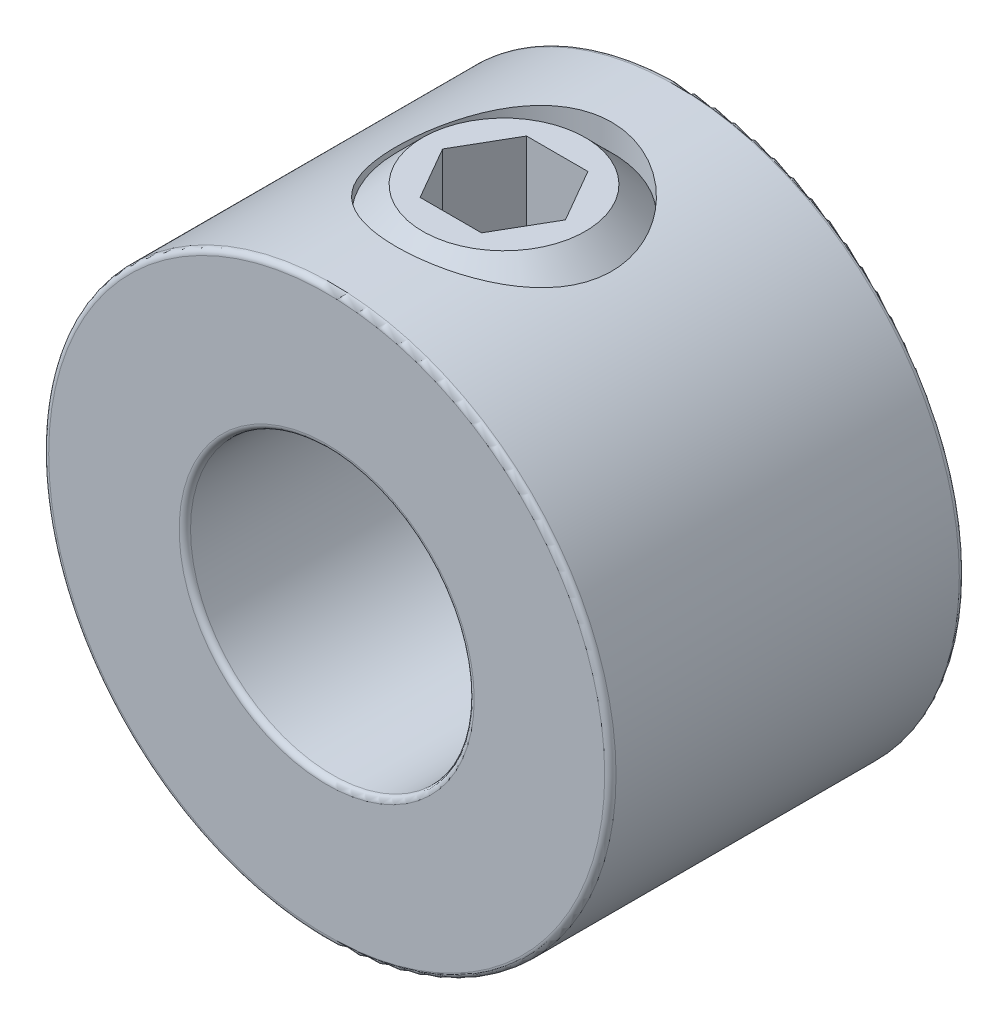
ISO-10303-21;
HEADER;
FILE_DESCRIPTION(('STEP AP214'),'2;1');
FILE_NAME('part.step','',(''),(''),'','','');
FILE_SCHEMA(('AUTOMOTIVE_DESIGN { 1 0 10303 214 1 1 1 1 }'));
ENDSEC;
DATA;
#1=APPLICATION_CONTEXT('core data for automotive mechanical design processes');
#2=APPLICATION_PROTOCOL_DEFINITION('international standard','automotive_design',2000,#1);
#3=PRODUCT_CONTEXT('',#1,'mechanical');
#4=PRODUCT('Part','Part','',(#3));
#5=PRODUCT_RELATED_PRODUCT_CATEGORY('part','',(#4));
#6=PRODUCT_DEFINITION_FORMATION('','',#4);
#7=PRODUCT_DEFINITION_CONTEXT('part definition',#1,'design');
#8=PRODUCT_DEFINITION('design','',#6,#7);
#9=PRODUCT_DEFINITION_SHAPE('','',#8);
#10=(LENGTH_UNIT() NAMED_UNIT(*) SI_UNIT(.MILLI.,.METRE.));
#11=(NAMED_UNIT(*) PLANE_ANGLE_UNIT() SI_UNIT($,.RADIAN.));
#12=(NAMED_UNIT(*) SI_UNIT($,.STERADIAN.) SOLID_ANGLE_UNIT());
#13=UNCERTAINTY_MEASURE_WITH_UNIT(LENGTH_MEASURE(1.E-05),#10,'distance_accuracy_value','');
#14=(GEOMETRIC_REPRESENTATION_CONTEXT(3) GLOBAL_UNCERTAINTY_ASSIGNED_CONTEXT((#13)) GLOBAL_UNIT_ASSIGNED_CONTEXT((#10,
#11,#12)) REPRESENTATION_CONTEXT('',''));
#15=CARTESIAN_POINT('',(0.,0.,0.));
#16=DIRECTION('',(0.,0.,1.));
#17=DIRECTION('',(1.,0.,0.));
#18=AXIS2_PLACEMENT_3D('',#15,#16,#17);
#19=CARTESIAN_POINT('',(0.,6.35,0.));
#20=DIRECTION('',(0.,1.,0.));
#21=DIRECTION('',(-1.,0.,0.));
#22=AXIS2_PLACEMENT_3D('',#19,#20,#21);
#23=PLANE('',#22);
#24=CARTESIAN_POINT('',(0.,6.35,0.));
#25=DIRECTION('',(0.,1.,0.));
#26=DIRECTION('',(-1.,0.,0.));
#27=AXIS2_PLACEMENT_3D('',#24,#25,#26);
#28=CIRCLE('',#27,1.81975161629017);
#29=CARTESIAN_POINT('',(-1.81975161629017,6.35,0.));
#30=VERTEX_POINT('',#29);
#31=EDGE_CURVE('E12',#30,#30,#28,.T.);
#32=ORIENTED_EDGE('',*,*,#31,.T.);
#33=EDGE_LOOP('',(#32));
#34=FACE_BOUND('',#33,.T.);
#35=DIRECTION('',(1.,0.,0.));
#36=VECTOR('',#35,1.);
#37=CARTESIAN_POINT('',(-0.687407664253898,6.34999999999999,-1.190625));
#38=LINE('',#37,#36);
#39=CARTESIAN_POINT('',(-0.687407664253898,6.34999999999999,-1.190625));
#40=VERTEX_POINT('',#39);
#41=CARTESIAN_POINT('',(0.687407664253898,6.35,-1.190625));
#42=VERTEX_POINT('',#41);
#43=EDGE_CURVE('E114',#40,#42,#38,.T.);
#44=ORIENTED_EDGE('',*,*,#43,.T.);
#45=DIRECTION('',(0.5,0.,0.866025403784439));
#46=VECTOR('',#45,1.);
#47=CARTESIAN_POINT('',(0.687407664253898,6.34999999999999,-1.190625));
#48=LINE('',#47,#46);
#49=CARTESIAN_POINT('',(1.3748153285078,6.34999999999999,0.));
#50=VERTEX_POINT('',#49);
#51=EDGE_CURVE('E60',#42,#50,#48,.T.);
#52=ORIENTED_EDGE('',*,*,#51,.T.);
#53=DIRECTION('',(-0.5,0.,0.866025403784439));
#54=VECTOR('',#53,1.);
#55=CARTESIAN_POINT('',(1.3748153285078,6.34999999999999,0.));
#56=LINE('',#55,#54);
#57=CARTESIAN_POINT('',(0.687407664253899,6.34999999999999,1.190625));
#58=VERTEX_POINT('',#57);
#59=EDGE_CURVE('E118',#50,#58,#56,.T.);
#60=ORIENTED_EDGE('',*,*,#59,.T.);
#61=DIRECTION('',(-1.,0.,0.));
#62=VECTOR('',#61,1.);
#63=CARTESIAN_POINT('',(0.687407664253899,6.34999999999999,1.190625));
#64=LINE('',#63,#62);
#65=CARTESIAN_POINT('',(-0.687407664253899,6.34999999999999,1.190625));
#66=VERTEX_POINT('',#65);
#67=EDGE_CURVE('E181',#58,#66,#64,.T.);
#68=ORIENTED_EDGE('',*,*,#67,.T.);
#69=DIRECTION('',(-0.5,0.,-0.866025403784439));
#70=VECTOR('',#69,1.);
#71=CARTESIAN_POINT('',(-0.687407664253899,6.34999999999999,1.190625));
#72=LINE('',#71,#70);
#73=CARTESIAN_POINT('',(-1.3748153285078,6.34999999999999,0.));
#74=VERTEX_POINT('',#73);
#75=EDGE_CURVE('E166',#66,#74,#72,.T.);
#76=ORIENTED_EDGE('',*,*,#75,.T.);
#77=DIRECTION('',(0.5,0.,-0.866025403784439));
#78=VECTOR('',#77,1.);
#79=CARTESIAN_POINT('',(-1.3748153285078,6.34999999999999,0.));
#80=LINE('',#79,#78);
#81=EDGE_CURVE('E162',#74,#40,#80,.T.);
#82=ORIENTED_EDGE('',*,*,#81,.T.);
#83=EDGE_LOOP('',(#44,#52,#60,#68,#76,#82));
#84=FACE_BOUND('',#83,.T.);
#85=ADVANCED_FACE('F46',(#34,#84),#23,.T.);
#86=CARTESIAN_POINT('',(0.,6.35,0.));
#87=DIRECTION('',(0.,-1.,0.));
#88=DIRECTION('',(1.,0.,0.));
#89=AXIS2_PLACEMENT_3D('',#86,#87,#88);
#90=CONICAL_SURFACE('',#89,1.81975161629017,0.785398163397448);
#91=CARTESIAN_POINT('',(0.,5.75675161629017,0.));
#92=DIRECTION('',(0.,1.,0.));
#93=DIRECTION('',(-1.,0.,0.));
#94=AXIS2_PLACEMENT_3D('',#91,#92,#93);
#95=CIRCLE('',#94,2.413);
#96=CARTESIAN_POINT('',(-2.413,5.75675161629017,0.));
#97=VERTEX_POINT('',#96);
#98=EDGE_CURVE('E53',#97,#97,#95,.T.);
#99=ORIENTED_EDGE('',*,*,#98,.T.);
#100=EDGE_LOOP('',(#99));
#101=FACE_BOUND('',#100,.T.);
#102=ORIENTED_EDGE('',*,*,#31,.F.);
#103=EDGE_LOOP('',(#102));
#104=FACE_BOUND('',#103,.T.);
#105=ADVANCED_FACE('F136',(#101,#104),#90,.T.);
#106=CARTESIAN_POINT('',(0.,3.175,0.));
#107=DIRECTION('',(0.,1.,0.));
#108=DIRECTION('',(-1.,0.,0.));
#109=AXIS2_PLACEMENT_3D('',#106,#107,#108);
#110=CYLINDRICAL_SURFACE('',#109,2.413);
#111=CARTESIAN_POINT('',(0.,3.76824838370983,0.));
#112=DIRECTION('',(0.,1.,0.));
#113=DIRECTION('',(-1.,0.,0.));
#114=AXIS2_PLACEMENT_3D('',#111,#112,#113);
#115=CIRCLE('',#114,2.413);
#116=CARTESIAN_POINT('',(-2.413,3.76824838370983,0.));
#117=VERTEX_POINT('',#116);
#118=EDGE_CURVE('E131',#117,#117,#115,.T.);
#119=ORIENTED_EDGE('',*,*,#118,.T.);
#120=EDGE_LOOP('',(#119));
#121=FACE_BOUND('',#120,.T.);
#122=ORIENTED_EDGE('',*,*,#98,.F.);
#123=EDGE_LOOP('',(#122));
#124=FACE_BOUND('',#123,.T.);
#125=ADVANCED_FACE('F139',(#121,#124),#110,.T.);
#126=CARTESIAN_POINT('',(0.,3.76824838370983,0.));
#127=DIRECTION('',(0.,1.,0.));
#128=DIRECTION('',(-1.,0.,0.));
#129=AXIS2_PLACEMENT_3D('',#126,#127,#128);
#130=CONICAL_SURFACE('',#129,2.413,0.785398163397449);
#131=CARTESIAN_POINT('',(0.,3.175,0.));
#132=DIRECTION('',(0.,1.,0.));
#133=DIRECTION('',(-1.,0.,0.));
#134=AXIS2_PLACEMENT_3D('',#131,#132,#133);
#135=CIRCLE('',#134,1.81975161629017);
#136=CARTESIAN_POINT('',(-1.81975161629017,3.175,0.));
#137=VERTEX_POINT('',#136);
#138=EDGE_CURVE('E123',#137,#137,#135,.T.);
#139=ORIENTED_EDGE('',*,*,#138,.T.);
#140=EDGE_LOOP('',(#139));
#141=FACE_BOUND('',#140,.T.);
#142=ORIENTED_EDGE('',*,*,#118,.F.);
#143=EDGE_LOOP('',(#142));
#144=FACE_BOUND('',#143,.T.);
#145=ADVANCED_FACE('F141',(#141,#144),#130,.T.);
#146=CARTESIAN_POINT('',(-1.81975161629017,3.175,0.));
#147=DIRECTION('',(0.,-1.,0.));
#148=DIRECTION('',(1.,0.,0.));
#149=AXIS2_PLACEMENT_3D('',#146,#147,#148);
#150=PLANE('',#149);
#151=CARTESIAN_POINT('',(0.,3.175,0.));
#152=DIRECTION('',(0.,1.,0.));
#153=DIRECTION('',(-1.,0.,0.));
#154=AXIS2_PLACEMENT_3D('',#151,#152,#153);
#155=CIRCLE('',#154,0.711898060451797);
#156=CARTESIAN_POINT('',(-0.711898060451796,3.175,0.));
#157=VERTEX_POINT('',#156);
#158=EDGE_CURVE('E119',#157,#157,#155,.T.);
#159=ORIENTED_EDGE('',*,*,#158,.T.);
#160=EDGE_LOOP('',(#159));
#161=FACE_BOUND('',#160,.T.);
#162=ORIENTED_EDGE('',*,*,#138,.F.);
#163=EDGE_LOOP('',(#162));
#164=FACE_BOUND('',#163,.T.);
#165=ADVANCED_FACE('F148',(#161,#164),#150,.T.);
#166=CARTESIAN_POINT('',(0.,3.175,0.));
#167=DIRECTION('',(0.,-1.,0.));
#168=DIRECTION('',(1.,0.,0.));
#169=AXIS2_PLACEMENT_3D('',#166,#167,#168);
#170=CONICAL_SURFACE('',#169,0.711898060451797,0.785398163397448);
#171=CARTESIAN_POINT('',(0.,3.8868980604518,0.));
#172=VERTEX_POINT('',#171);
#173=VERTEX_LOOP('',#172);
#174=FACE_BOUND('',#173,.T.);
#175=ORIENTED_EDGE('',*,*,#158,.F.);
#176=EDGE_LOOP('',(#175));
#177=FACE_BOUND('',#176,.T.);
#178=ADVANCED_FACE('F215',(#174,#177),#170,.F.);
#179=CARTESIAN_POINT('',(0.687407664253898,3.96874999999999,-1.190625));
#180=DIRECTION('',(-0.866025403784439,0.,0.5));
#181=DIRECTION('',(0.5,0.,0.866025403784438));
#182=AXIS2_PLACEMENT_3D('',#179,#180,#181);
#183=PLANE('',#182);
#184=ORIENTED_EDGE('',*,*,#51,.F.);
#185=DIRECTION('',(0.,1.,0.));
#186=VECTOR('',#185,1.);
#187=CARTESIAN_POINT('',(0.687407664253898,3.96874999999999,-1.190625));
#188=LINE('',#187,#186);
#189=CARTESIAN_POINT('',(0.687407664253898,3.96874999999999,-1.190625));
#190=VERTEX_POINT('',#189);
#191=EDGE_CURVE('E113',#190,#42,#188,.T.);
#192=ORIENTED_EDGE('',*,*,#191,.F.);
#193=DIRECTION('',(0.5,0.,0.866025403784439));
#194=VECTOR('',#193,1.);
#195=CARTESIAN_POINT('',(0.687407664253898,3.96874999999999,-1.190625));
#196=LINE('',#195,#194);
#197=CARTESIAN_POINT('',(1.3748153285078,3.96874999999999,0.));
#198=VERTEX_POINT('',#197);
#199=EDGE_CURVE('E104',#190,#198,#196,.T.);
#200=ORIENTED_EDGE('',*,*,#199,.T.);
#201=DIRECTION('',(0.,1.,0.));
#202=VECTOR('',#201,1.);
#203=CARTESIAN_POINT('',(1.3748153285078,3.96874999999999,0.));
#204=LINE('',#203,#202);
#205=EDGE_CURVE('E112',#198,#50,#204,.T.);
#206=ORIENTED_EDGE('',*,*,#205,.T.);
#207=EDGE_LOOP('',(#184,#192,#200,#206));
#208=FACE_BOUND('',#207,.T.);
#209=ADVANCED_FACE('F111',(#208),#183,.T.);
#210=CARTESIAN_POINT('',(1.3748153285078,3.96874999999999,0.));
#211=DIRECTION('',(-0.866025403784439,0.,-0.5));
#212=DIRECTION('',(-0.5,0.,0.866025403784439));
#213=AXIS2_PLACEMENT_3D('',#210,#211,#212);
#214=PLANE('',#213);
#215=ORIENTED_EDGE('',*,*,#59,.F.);
#216=ORIENTED_EDGE('',*,*,#205,.F.);
#217=DIRECTION('',(-0.5,0.,0.866025403784439));
#218=VECTOR('',#217,1.);
#219=CARTESIAN_POINT('',(1.3748153285078,3.96874999999999,0.));
#220=LINE('',#219,#218);
#221=CARTESIAN_POINT('',(0.687407664253899,3.96874999999999,1.190625));
#222=VERTEX_POINT('',#221);
#223=EDGE_CURVE('E100',#198,#222,#220,.T.);
#224=ORIENTED_EDGE('',*,*,#223,.T.);
#225=DIRECTION('',(0.,1.,0.));
#226=VECTOR('',#225,1.);
#227=CARTESIAN_POINT('',(0.687407664253899,3.96874999999999,1.190625));
#228=LINE('',#227,#226);
#229=EDGE_CURVE('E120',#222,#58,#228,.T.);
#230=ORIENTED_EDGE('',*,*,#229,.T.);
#231=EDGE_LOOP('',(#215,#216,#224,#230));
#232=FACE_BOUND('',#231,.T.);
#233=ADVANCED_FACE('F116',(#232),#214,.T.);
#234=CARTESIAN_POINT('',(0.687407664253899,3.96874999999999,1.190625));
#235=DIRECTION('',(0.,0.,-1.));
#236=DIRECTION('',(-1.,0.,0.));
#237=AXIS2_PLACEMENT_3D('',#234,#235,#236);
#238=PLANE('',#237);
#239=ORIENTED_EDGE('',*,*,#67,.F.);
#240=ORIENTED_EDGE('',*,*,#229,.F.);
#241=DIRECTION('',(-1.,0.,0.));
#242=VECTOR('',#241,1.);
#243=CARTESIAN_POINT('',(0.687407664253899,3.96874999999999,1.190625));
#244=LINE('',#243,#242);
#245=CARTESIAN_POINT('',(-0.687407664253899,3.96874999999999,1.190625));
#246=VERTEX_POINT('',#245);
#247=EDGE_CURVE('E106',#222,#246,#244,.T.);
#248=ORIENTED_EDGE('',*,*,#247,.T.);
#249=DIRECTION('',(0.,1.,0.));
#250=VECTOR('',#249,1.);
#251=CARTESIAN_POINT('',(-0.687407664253899,3.96874999999999,1.190625));
#252=LINE('',#251,#250);
#253=EDGE_CURVE('E125',#246,#66,#252,.T.);
#254=ORIENTED_EDGE('',*,*,#253,.T.);
#255=EDGE_LOOP('',(#239,#240,#248,#254));
#256=FACE_BOUND('',#255,.T.);
#257=ADVANCED_FACE('F179',(#256),#238,.T.);
#258=CARTESIAN_POINT('',(-0.687407664253899,3.96874999999999,1.190625));
#259=DIRECTION('',(0.866025403784439,0.,-0.5));
#260=DIRECTION('',(-0.5,0.,-0.866025403784439));
#261=AXIS2_PLACEMENT_3D('',#258,#259,#260);
#262=PLANE('',#261);
#263=ORIENTED_EDGE('',*,*,#75,.F.);
#264=ORIENTED_EDGE('',*,*,#253,.F.);
#265=DIRECTION('',(-0.5,0.,-0.866025403784439));
#266=VECTOR('',#265,1.);
#267=CARTESIAN_POINT('',(-0.687407664253899,3.96874999999999,1.190625));
#268=LINE('',#267,#266);
#269=CARTESIAN_POINT('',(-1.3748153285078,3.96874999999999,0.));
#270=VERTEX_POINT('',#269);
#271=EDGE_CURVE('E192',#246,#270,#268,.T.);
#272=ORIENTED_EDGE('',*,*,#271,.T.);
#273=DIRECTION('',(0.,1.,0.));
#274=VECTOR('',#273,1.);
#275=CARTESIAN_POINT('',(-1.3748153285078,3.96874999999999,0.));
#276=LINE('',#275,#274);
#277=EDGE_CURVE('E174',#270,#74,#276,.T.);
#278=ORIENTED_EDGE('',*,*,#277,.T.);
#279=EDGE_LOOP('',(#263,#264,#272,#278));
#280=FACE_BOUND('',#279,.T.);
#281=ADVANCED_FACE('F183',(#280),#262,.T.);
#282=CARTESIAN_POINT('',(-1.3748153285078,3.96874999999999,0.));
#283=DIRECTION('',(0.866025403784439,0.,0.5));
#284=DIRECTION('',(0.5,0.,-0.866025403784439));
#285=AXIS2_PLACEMENT_3D('',#282,#283,#284);
#286=PLANE('',#285);
#287=ORIENTED_EDGE('',*,*,#81,.F.);
#288=ORIENTED_EDGE('',*,*,#277,.F.);
#289=DIRECTION('',(0.5,0.,-0.866025403784439));
#290=VECTOR('',#289,1.);
#291=CARTESIAN_POINT('',(-1.3748153285078,3.96874999999999,0.));
#292=LINE('',#291,#290);
#293=CARTESIAN_POINT('',(-0.687407664253898,3.96874999999999,-1.190625));
#294=VERTEX_POINT('',#293);
#295=EDGE_CURVE('E190',#270,#294,#292,.T.);
#296=ORIENTED_EDGE('',*,*,#295,.T.);
#297=DIRECTION('',(0.,1.,0.));
#298=VECTOR('',#297,1.);
#299=CARTESIAN_POINT('',(-0.687407664253898,3.96874999999999,-1.190625));
#300=LINE('',#299,#298);
#301=EDGE_CURVE('E171',#294,#40,#300,.T.);
#302=ORIENTED_EDGE('',*,*,#301,.T.);
#303=EDGE_LOOP('',(#287,#288,#296,#302));
#304=FACE_BOUND('',#303,.T.);
#305=ADVANCED_FACE('F196',(#304),#286,.T.);
#306=CARTESIAN_POINT('',(-0.687407664253898,3.96874999999999,-1.190625));
#307=DIRECTION('',(0.,0.,1.));
#308=DIRECTION('',(1.,0.,0.));
#309=AXIS2_PLACEMENT_3D('',#306,#307,#308);
#310=PLANE('',#309);
#311=ORIENTED_EDGE('',*,*,#43,.F.);
#312=ORIENTED_EDGE('',*,*,#301,.F.);
#313=DIRECTION('',(1.,0.,0.));
#314=VECTOR('',#313,1.);
#315=CARTESIAN_POINT('',(-0.687407664253898,3.96874999999999,-1.190625));
#316=LINE('',#315,#314);
#317=EDGE_CURVE('E172',#294,#190,#316,.T.);
#318=ORIENTED_EDGE('',*,*,#317,.T.);
#319=ORIENTED_EDGE('',*,*,#191,.T.);
#320=EDGE_LOOP('',(#311,#312,#318,#319));
#321=FACE_BOUND('',#320,.T.);
#322=ADVANCED_FACE('F197',(#321),#310,.T.);
#323=CARTESIAN_POINT('',(0.687407664253898,3.96874999999999,-1.190625));
#324=DIRECTION('',(0.,1.,0.));
#325=DIRECTION('',(0.,0.,1.));
#326=AXIS2_PLACEMENT_3D('',#323,#324,#325);
#327=PLANE('',#326);
#328=ORIENTED_EDGE('',*,*,#199,.F.);
#329=ORIENTED_EDGE('',*,*,#317,.F.);
#330=ORIENTED_EDGE('',*,*,#295,.F.);
#331=ORIENTED_EDGE('',*,*,#271,.F.);
#332=ORIENTED_EDGE('',*,*,#247,.F.);
#333=ORIENTED_EDGE('',*,*,#223,.F.);
#334=EDGE_LOOP('',(#328,#329,#330,#331,#332,#333));
#335=FACE_BOUND('',#334,.T.);
#336=ADVANCED_FACE('F102',(#335),#327,.T.);
#337=CLOSED_SHELL('',(#85,#105,#125,#145,#165,#178,#209,#233,#257,#281,#305,#322,#336));
#338=MANIFOLD_SOLID_BREP('B2',#337);
#339=CARTESIAN_POINT('',(0.,0.,3.96875));
#340=DIRECTION('',(0.,0.,1.));
#341=DIRECTION('',(1.,0.,0.));
#342=AXIS2_PLACEMENT_3D('',#339,#340,#341);
#343=PLANE('',#342);
#344=CARTESIAN_POINT('',(0.,0.,3.96875));
#345=DIRECTION('',(0.,0.,1.));
#346=DIRECTION('',(1.,0.,0.));
#347=AXIS2_PLACEMENT_3D('',#344,#345,#346);
#348=CIRCLE('',#347,3.302);
#349=CARTESIAN_POINT('',(3.302,0.,3.96875));
#350=VERTEX_POINT('',#349);
#351=EDGE_CURVE('E311',#350,#350,#348,.F.);
#352=ORIENTED_EDGE('',*,*,#351,.T.);
#353=EDGE_LOOP('',(#352));
#354=FACE_BOUND('',#353,.T.);
#355=CARTESIAN_POINT('',(0.,0.,3.96875));
#356=DIRECTION('',(0.,0.,1.));
#357=DIRECTION('',(1.,0.,0.));
#358=AXIS2_PLACEMENT_3D('',#355,#356,#357);
#359=CIRCLE('',#358,6.223);
#360=CARTESIAN_POINT('',(6.223,0.,3.96875));
#361=VERTEX_POINT('',#360);
#362=EDGE_CURVE('E315',#361,#361,#359,.T.);
#363=ORIENTED_EDGE('',*,*,#362,.T.);
#364=EDGE_LOOP('',(#363));
#365=FACE_BOUND('',#364,.T.);
#366=ADVANCED_FACE('F300',(#354,#365),#343,.T.);
#367=CARTESIAN_POINT('',(0.,0.,-3.96875));
#368=DIRECTION('',(0.,0.,1.));
#369=DIRECTION('',(1.,0.,0.));
#370=AXIS2_PLACEMENT_3D('',#367,#368,#369);
#371=PLANE('',#370);
#372=CARTESIAN_POINT('',(0.,0.,-3.96875));
#373=DIRECTION('',(0.,0.,1.));
#374=DIRECTION('',(1.,0.,0.));
#375=AXIS2_PLACEMENT_3D('',#372,#373,#374);
#376=CIRCLE('',#375,3.302);
#377=CARTESIAN_POINT('',(3.302,0.,-3.96875));
#378=VERTEX_POINT('',#377);
#379=EDGE_CURVE('E326',#378,#378,#376,.T.);
#380=ORIENTED_EDGE('',*,*,#379,.T.);
#381=EDGE_LOOP('',(#380));
#382=FACE_BOUND('',#381,.T.);
#383=CARTESIAN_POINT('',(0.,0.,-3.96875));
#384=DIRECTION('',(0.,0.,1.));
#385=DIRECTION('',(1.,0.,0.));
#386=AXIS2_PLACEMENT_3D('',#383,#384,#385);
#387=CIRCLE('',#386,6.223);
#388=CARTESIAN_POINT('',(6.223,0.,-3.96875));
#389=VERTEX_POINT('',#388);
#390=EDGE_CURVE('E329',#389,#389,#387,.F.);
#391=ORIENTED_EDGE('',*,*,#390,.T.);
#392=EDGE_LOOP('',(#391));
#393=FACE_BOUND('',#392,.T.);
#394=ADVANCED_FACE('F365',(#382,#393),#371,.F.);
#395=CARTESIAN_POINT('',(0.,0.,3.96875));
#396=DIRECTION('',(0.,0.,-1.));
#397=DIRECTION('',(-1.,0.,0.));
#398=AXIS2_PLACEMENT_3D('',#395,#396,#397);
#399=CYLINDRICAL_SURFACE('',#398,6.35);
#400=CARTESIAN_POINT('',(0.,0.,-3.84175));
#401=DIRECTION('',(0.,0.,1.));
#402=DIRECTION('',(1.,0.,0.));
#403=AXIS2_PLACEMENT_3D('',#400,#401,#402);
#404=CIRCLE('',#403,6.35);
#405=CARTESIAN_POINT('',(6.35,0.,-3.84175));
#406=VERTEX_POINT('',#405);
#407=EDGE_CURVE('E45',#406,#406,#404,.T.);
#408=ORIENTED_EDGE('',*,*,#407,.T.);
#409=EDGE_LOOP('',(#408));
#410=FACE_BOUND('',#409,.T.);
#411=CARTESIAN_POINT('',(0.,0.,3.84175));
#412=DIRECTION('',(0.,0.,1.));
#413=DIRECTION('',(1.,0.,0.));
#414=AXIS2_PLACEMENT_3D('',#411,#412,#413);
#415=CIRCLE('',#414,6.35);
#416=CARTESIAN_POINT('',(6.35,0.,3.84175));
#417=VERTEX_POINT('',#416);
#418=EDGE_CURVE('E307',#417,#417,#415,.F.);
#419=ORIENTED_EDGE('',*,*,#418,.T.);
#420=EDGE_LOOP('',(#419));
#421=FACE_BOUND('',#420,.T.);
#422=CARTESIAN_POINT('',(0.,6.35,-2.413));
#423=CARTESIAN_POINT('',(0.130555931467962,6.35000398969011,-2.41300527534602));
#424=CARTESIAN_POINT('',(0.261076241377739,6.34593890816647,-2.4023714543113));
#425=CARTESIAN_POINT('',(0.518209446534913,6.33012963929965,-2.36029479676423));
#426=CARTESIAN_POINT('',(0.644823015088655,6.31838678300935,-2.32885556715778));
#427=CARTESIAN_POINT('',(0.890396734122701,6.28848040494,-2.24644511602075));
#428=CARTESIAN_POINT('',(1.00937135935963,6.27032947705095,-2.19551218938446));
#429=CARTESIAN_POINT('',(1.23707694907279,6.22940932060409,-2.07575764561934));
#430=CARTESIAN_POINT('',(1.34580507871092,6.20663881943741,-2.00693109764769));
#431=CARTESIAN_POINT('',(1.5546544090621,6.15771932779737,-1.85022277092613));
#432=CARTESIAN_POINT('',(1.65427192875035,6.13147296383124,-1.76170041624995));
#433=CARTESIAN_POINT('',(1.83765571561736,6.07903240405007,-1.56947315042905));
#434=CARTESIAN_POINT('',(1.92141693988139,6.05283822744466,-1.46576342765122));
#435=CARTESIAN_POINT('',(2.07395660623911,6.00232668170519,-1.24113386470124));
#436=CARTESIAN_POINT('',(2.14201618015845,5.97812365120729,-1.11969756154783));
#437=CARTESIAN_POINT('',(2.25652093858858,5.93585432476053,-0.866038380432351));
#438=CARTESIAN_POINT('',(2.30297502037546,5.91778550353544,-0.733819969020803));
#439=CARTESIAN_POINT('',(2.37094947712185,5.89087364983883,-0.46815363189803));
#440=CARTESIAN_POINT('',(2.39343294050412,5.88167580744491,-0.334989300795486));
#441=CARTESIAN_POINT('',(2.41583880524757,5.87251090464605,-0.0664845962936197));
#442=CARTESIAN_POINT('',(2.41577084821779,5.87253989940926,0.0688548224232351));
#443=CARTESIAN_POINT('',(2.39381090108878,5.88152011871453,0.328972227003014));
#444=CARTESIAN_POINT('',(2.37326609797153,5.88992057372023,0.453886522563246));
#445=CARTESIAN_POINT('',(2.31316652422954,5.91378008823147,0.698339704990829));
#446=CARTESIAN_POINT('',(2.27360881167116,5.92924024008996,0.817877756841903));
#447=CARTESIAN_POINT('',(2.17588364092748,5.96580146890692,1.0508916152852));
#448=CARTESIAN_POINT('',(2.11737290423754,5.98700531598431,1.16420661484106));
#449=CARTESIAN_POINT('',(1.98364217411328,6.03263175509447,1.37979639920587));
#450=CARTESIAN_POINT('',(1.90841630395244,6.05705547794376,1.4820672822727));
#451=CARTESIAN_POINT('',(1.73726689770536,6.10842961274997,1.68010694238863));
#452=CARTESIAN_POINT('',(1.64027173491613,6.13543795015635,1.77493688260015));
#453=CARTESIAN_POINT('',(1.43144868882472,6.18748920351012,1.94726806056401));
#454=CARTESIAN_POINT('',(1.31961840653187,6.2125318005324,2.02476649017818));
#455=CARTESIAN_POINT('',(1.08185265975391,6.25835188225341,2.16130771487283));
#456=CARTESIAN_POINT('',(0.955717417234618,6.27905339803369,2.22002994310971));
#457=CARTESIAN_POINT('',(0.694375189035109,6.31329326294077,2.31510736575226));
#458=CARTESIAN_POINT('',(0.559172376611221,6.32683488218724,2.3514727723643));
#459=CARTESIAN_POINT('',(0.291428150212525,6.3446501972992,2.39898109857718));
#460=CARTESIAN_POINT('',(0.159141645079808,6.34938771868047,2.41138775288999));
#461=CARTESIAN_POINT('',(-0.105693065348276,6.35049981057155,2.41431626348443));
#462=CARTESIAN_POINT('',(-0.238241203822052,6.34687629478166,2.40484312768025));
#463=CARTESIAN_POINT('',(-0.494323602805378,6.33197908606406,2.36523562382545));
#464=CARTESIAN_POINT('',(-0.61800684441211,6.32101461634214,2.33593589818825));
#465=CARTESIAN_POINT('',(-0.858609565436108,6.29285092848222,2.25861304376362));
#466=CARTESIAN_POINT('',(-0.975528163914414,6.27565090041604,2.21058748264173));
#467=CARTESIAN_POINT('',(-1.20317276582384,6.23607457125026,2.09563503714011));
#468=CARTESIAN_POINT('',(-1.3136121499673,6.21355984396609,2.02818967610491));
#469=CARTESIAN_POINT('',(-1.52197988578177,6.16583504517286,1.87689595883598));
#470=CARTESIAN_POINT('',(-1.61990351002366,6.14062396176678,1.79304143465584));
#471=CARTESIAN_POINT('',(-1.80656807112922,6.08841217199752,1.60543272496061));
#472=CARTESIAN_POINT('',(-1.89441393314817,6.06139435477813,1.5007904098217));
#473=CARTESIAN_POINT('',(-2.05148411432654,6.01005496187559,1.27772800811267));
#474=CARTESIAN_POINT('',(-2.12070651399853,5.98573366426972,1.15930650314625));
#475=CARTESIAN_POINT('',(-2.23870023772464,5.94261798623815,0.910922748538602));
#476=CARTESIAN_POINT('',(-2.28736466342468,5.92385264334907,0.780904332023381));
#477=CARTESIAN_POINT('',(-2.36177800946808,5.89458517077402,0.513602694331982));
#478=CARTESIAN_POINT('',(-2.38754162954713,5.8840777409413,0.376324193363579));
#479=CARTESIAN_POINT('',(-2.41408994040532,5.87323215610138,0.108127165215383));
#480=CARTESIAN_POINT('',(-2.41640623148607,5.87227054588007,-0.0226157343841075));
#481=CARTESIAN_POINT('',(-2.3999373204655,5.8790202253426,-0.282524873396556));
#482=CARTESIAN_POINT('',(-2.38115423316032,5.88673064582666,-0.41169126951125));
#483=CARTESIAN_POINT('',(-2.32422421188573,5.90943043237583,-0.660552265849344));
#484=CARTESIAN_POINT('',(-2.28672002796391,5.92417751295514,-0.780417919491674));
#485=CARTESIAN_POINT('',(-2.19398528189399,5.95914188552999,-1.01222145618602));
#486=CARTESIAN_POINT('',(-2.13875018285588,5.97936057736356,-1.12415730124382));
#487=CARTESIAN_POINT('',(-2.00869997639504,6.02433337271119,-1.34342800575803));
#488=CARTESIAN_POINT('',(-1.93299650808671,6.04927206356278,-1.4501976241717));
#489=CARTESIAN_POINT('',(-1.76551836882645,6.10025417003155,-1.65000619367226));
#490=CARTESIAN_POINT('',(-1.67373852090438,6.12629793945648,-1.74304070389426));
#491=CARTESIAN_POINT('',(-1.47055494697206,6.17831294001547,-1.91807209951937));
#492=CARTESIAN_POINT('',(-1.35833856072122,6.20419794006484,-1.99915556641372));
#493=CARTESIAN_POINT('',(-1.12096041375387,6.25144642675378,-2.14129762074769));
#494=CARTESIAN_POINT('',(-0.995797050693124,6.27280935273315,-2.20235372565052));
#495=CARTESIAN_POINT('',(-0.728778395788011,6.30955475572144,-2.30499263616226));
#496=CARTESIAN_POINT('',(-0.58638469778337,6.32454657619379,-2.3453288052365));
#497=CARTESIAN_POINT('',(-0.295976705251577,6.34476431329028,-2.39932232882264));
#498=CARTESIAN_POINT('',(-0.147965475024477,6.34999547828747,-2.41299402119021));
#499=CARTESIAN_POINT('',(0.,6.35,-2.413));
#500=B_SPLINE_CURVE_WITH_KNOTS('',3,(#422,#423,#424,#425,#426,#427,#428,#429,#430,#431,#432,
#433,#434,#435,#436,#437,#438,#439,#440,#441,#442,#443,#444,#445,#446,#447,#448,#449,#450,#451,
#452,#453,#454,#455,#456,#457,#458,#459,#460,#461,#462,#463,#464,#465,#466,#467,#468,#469,#470,
#471,#472,#473,#474,#475,#476,#477,#478,#479,#480,#481,#482,#483,#484,#485,#486,#487,#488,#489,
#490,#491,#492,#493,#494,#495,#496,#497,#498,#499),.UNSPECIFIED.,.T.,.F.,(4,2,2,2,2,2,2,2,2,2,2,
2,2,2,2,2,2,2,2,2,2,2,2,2,2,2,2,2,2,2,2,2,2,2,2,2,2,2,4),(0.,0.391121887064184,
0.782175985486185,1.17246577830223,1.56286323524963,1.96854634212709,2.37435825594016,
2.79613130529395,3.21773051175688,3.62166628723491,4.02542936468621,4.40427313209371,
4.78317553819666,5.16936515238192,5.55569075901495,5.96873424705112,6.38184461005431,
6.80167192308661,7.22130732355892,7.61812936188612,8.01486058335588,8.39585156202364,
8.77689204483065,9.16923685274999,9.56172942118012,9.9776135359701,10.3935404987953,
10.8116043631128,11.2293996833676,11.6197130905881,12.0099873800853,12.3876994067832,
12.7655081575183,13.1635000328781,13.5616203073395,13.9821012344605,14.4026342635628,
14.8461505355472,15.2894282569131),.UNSPECIFIED.);
#501=CARTESIAN_POINT('',(0.,6.35,-2.413));
#502=VERTEX_POINT('',#501);
#503=EDGE_CURVE('E332',#502,#502,#500,.T.);
#504=ORIENTED_EDGE('',*,*,#503,.T.);
#505=EDGE_LOOP('',(#504));
#506=FACE_BOUND('',#505,.T.);
#507=ADVANCED_FACE('F361',(#410,#421,#506),#399,.T.);
#508=CARTESIAN_POINT('',(0.,0.,3.96875));
#509=DIRECTION('',(0.,0.,-1.));
#510=DIRECTION('',(-1.,0.,0.));
#511=AXIS2_PLACEMENT_3D('',#508,#509,#510);
#512=CYLINDRICAL_SURFACE('',#511,3.175);
#513=CARTESIAN_POINT('',(0.,0.,-3.84175));
#514=DIRECTION('',(0.,0.,1.));
#515=DIRECTION('',(1.,0.,0.));
#516=AXIS2_PLACEMENT_3D('',#513,#514,#515);
#517=CIRCLE('',#516,3.175);
#518=CARTESIAN_POINT('',(3.175,0.,-3.84175));
#519=VERTEX_POINT('',#518);
#520=EDGE_CURVE('E320',#519,#519,#517,.F.);
#521=ORIENTED_EDGE('',*,*,#520,.T.);
#522=EDGE_LOOP('',(#521));
#523=FACE_BOUND('',#522,.T.);
#524=CARTESIAN_POINT('',(0.,0.,3.84175));
#525=DIRECTION('',(0.,0.,1.));
#526=DIRECTION('',(1.,0.,0.));
#527=AXIS2_PLACEMENT_3D('',#524,#525,#526);
#528=CIRCLE('',#527,3.175);
#529=CARTESIAN_POINT('',(3.175,0.,3.84175));
#530=VERTEX_POINT('',#529);
#531=EDGE_CURVE('E323',#530,#530,#528,.T.);
#532=ORIENTED_EDGE('',*,*,#531,.T.);
#533=EDGE_LOOP('',(#532));
#534=FACE_BOUND('',#533,.T.);
#535=CARTESIAN_POINT('',(0.,3.175,-2.413));
#536=CARTESIAN_POINT('',(0.117443171605231,3.17499092904906,-2.41299058031907));
#537=CARTESIAN_POINT('',(0.23503818841931,3.16841692674332,-2.4043581847269));
#538=CARTESIAN_POINT('',(0.466484967913331,3.14271336140829,-2.37038175457781));
#539=CARTESIAN_POINT('',(0.580328596183407,3.12355818632314,-2.34500362950094));
#540=CARTESIAN_POINT('',(0.80033693546367,3.07452724978738,-2.27928432631256));
#541=CARTESIAN_POINT('',(0.906543039514099,3.04471549355359,-2.23903243487973));
#542=CARTESIAN_POINT('',(1.10997011785933,2.97659455342082,-2.14548015839209));
#543=CARTESIAN_POINT('',(1.20719255384311,2.93828675533249,-2.09218190121579));
#544=CARTESIAN_POINT('',(1.40022726688529,2.85170030734834,-1.96882085307546));
#545=CARTESIAN_POINT('',(1.49506365463583,2.80282512985173,-1.89765858122501));
#546=CARTESIAN_POINT('',(1.67223382567996,2.7008760546092,-1.7435641158176));
#547=CARTESIAN_POINT('',(1.75454859398162,2.64779595363648,-1.66061438438314));
#548=CARTESIAN_POINT('',(1.92203888294129,2.5296135351956,-1.46565859240837));
#549=CARTESIAN_POINT('',(2.00423140536036,2.4643124367144,-1.35120048467098));
#550=CARTESIAN_POINT('',(2.14857118710811,2.33951215894306,-1.10735736644856));
#551=CARTESIAN_POINT('',(2.21074385995913,2.28000569136514,-0.977991565717825));
#552=CARTESIAN_POINT('',(2.29462037317499,2.19490180220151,-0.752497308608559));
#553=CARTESIAN_POINT('',(2.32287346332998,2.16472241167552,-0.66055827907226));
#554=CARTESIAN_POINT('',(2.36849823013454,2.11470881226284,-0.47139038700259));
#555=CARTESIAN_POINT('',(2.38589523743028,2.09485053921884,-0.374174418255039));
#556=CARTESIAN_POINT('',(2.40870358471578,2.06860028206587,-0.175460476777278));
#557=CARTESIAN_POINT('',(2.4139959431512,2.06234200752845,-0.073929905731699));
#558=CARTESIAN_POINT('',(2.41169213967819,2.06503422028968,0.128798184800726));
#559=CARTESIAN_POINT('',(2.40409306334661,2.07398814667793,0.22999562379254));
#560=CARTESIAN_POINT('',(2.37836508518799,2.10340433920656,0.416917246134645));
#561=CARTESIAN_POINT('',(2.36156171265492,2.1224091464969,0.503073429560243));
#562=CARTESIAN_POINT('',(2.31942910669347,2.16837457604816,0.671064962974234));
#563=CARTESIAN_POINT('',(2.29409116468348,2.19534332114491,0.752895800354834));
#564=CARTESIAN_POINT('',(2.21702947004233,2.27376916611904,0.962631680289748));
#565=CARTESIAN_POINT('',(2.15880606368402,2.32983777456744,1.08642083974007));
#566=CARTESIAN_POINT('',(2.0240584670168,2.44783368287627,1.32063556736185));
#567=CARTESIAN_POINT('',(1.94748865288627,2.50977535205404,1.43102676980356));
#568=CARTESIAN_POINT('',(1.77457755480707,2.63500191833982,1.64086400526623));
#569=CARTESIAN_POINT('',(1.67772908569284,2.69827393808612,1.73990181478264));
#570=CARTESIAN_POINT('',(1.46641465679805,2.81868720555883,1.92133244794249));
#571=CARTESIAN_POINT('',(1.35198192561174,2.87583967861316,2.00375600179513));
#572=CARTESIAN_POINT('',(1.1302184691796,2.96897239724258,2.13504920976438));
#573=CARTESIAN_POINT('',(1.02573469648465,3.00691100546587,2.18732233798596));
#574=CARTESIAN_POINT('',(0.807524498934965,3.07269924184988,2.27691743542351));
#575=CARTESIAN_POINT('',(0.693803632023793,3.10055488265641,2.31424831636675));
#576=CARTESIAN_POINT('',(0.458986561176873,3.14392869528766,2.37204565582169));
#577=CARTESIAN_POINT('',(0.337846653718269,3.15936426972399,2.39239924216467));
#578=CARTESIAN_POINT('',(0.0929212408274502,3.17600778354888,2.41433718167044));
#579=CARTESIAN_POINT('',(-0.0308628412677098,3.17722319336241,2.41593138989231));
#580=CARTESIAN_POINT('',(-0.263113673769308,3.16598164725166,2.40112430213952));
#581=CARTESIAN_POINT('',(-0.371784896474092,3.15499411480433,2.38665711938384));
#582=CARTESIAN_POINT('',(-0.584657379974265,3.12256258934286,2.34361709819449));
#583=CARTESIAN_POINT('',(-0.688857782558675,3.10111659842469,2.31504156459624));
#584=CARTESIAN_POINT('',(-0.893151752270642,3.04866013703249,2.24429284461138));
#585=CARTESIAN_POINT('',(-0.993066473951875,3.01741404656932,2.20178337061745));
#586=CARTESIAN_POINT('',(-1.18427030490273,2.94762615076737,2.10512741976429));
#587=CARTESIAN_POINT('',(-1.27555811070553,2.90908324556455,2.05097918840424));
#588=CARTESIAN_POINT('',(-1.4629408219305,2.82008518778891,1.92283493337221));
#589=CARTESIAN_POINT('',(-1.55736336530955,2.76871323654288,1.84703979297132));
#590=CARTESIAN_POINT('',(-1.7330266340156,2.66229345480278,1.68334400808498));
#591=CARTESIAN_POINT('',(-1.81424018707203,2.60723836781931,1.59541908083344));
#592=CARTESIAN_POINT('',(-1.93310120506622,2.51929011373857,1.44596227809647));
#593=CARTESIAN_POINT('',(-1.97518148865632,2.48634042838264,1.38794003709871));
#594=CARTESIAN_POINT('',(-2.05424288960517,2.42143291492003,1.26799956797446));
#595=CARTESIAN_POINT('',(-2.09122218168265,2.38947544500995,1.2060799567393));
#596=CARTESIAN_POINT('',(-2.19405069763864,2.29677780916441,1.01470921513655));
#597=CARTESIAN_POINT('',(-2.25209423008379,2.2389759481709,0.879267670433414));
#598=CARTESIAN_POINT('',(-2.32600727289693,2.16148731453314,0.648667618119571));
#599=CARTESIAN_POINT('',(-2.34951337659766,2.13568591161393,0.557995127674168));
#600=CARTESIAN_POINT('',(-2.38597736286025,2.09487284834006,0.372275602812797));
#601=CARTESIAN_POINT('',(-2.39896041795918,2.0798354491901,0.277239585981548));
#602=CARTESIAN_POINT('',(-2.41347202601588,2.06298898322372,0.0843820043038626));
#603=CARTESIAN_POINT('',(-2.41491881071071,2.06127434940024,-0.0134545208329241));
#604=CARTESIAN_POINT('',(-2.40600289841214,2.07166816759277,-0.20788213648133));
#605=CARTESIAN_POINT('',(-2.39562846174622,2.08379036100337,-0.304471892411458));
#606=CARTESIAN_POINT('',(-2.36137219311358,2.12256830664758,-0.508834367656112));
#607=CARTESIAN_POINT('',(-2.33557340769404,2.15126142901359,-0.615881798172457));
#608=CARTESIAN_POINT('',(-2.27108364148613,2.21923176610734,-0.822515613730422));
#609=CARTESIAN_POINT('',(-2.2323592210675,2.25853638265596,-0.922081817130457));
#610=CARTESIAN_POINT('',(-2.12610942507655,2.35955877527054,-1.15053309693759));
#611=CARTESIAN_POINT('',(-2.05324191025264,2.42403799567888,-1.27569998264042));
#612=CARTESIAN_POINT('',(-1.88728411653423,2.55539518076956,-1.5104318596925));
#613=CARTESIAN_POINT('',(-1.79417076882036,2.62227580852244,-1.61997881541957));
#614=CARTESIAN_POINT('',(-1.58693666845894,2.75272337581287,-1.82362287315767));
#615=CARTESIAN_POINT('',(-1.47252844795802,2.81622750409905,-1.9174704362987));
#616=CARTESIAN_POINT('',(-1.22472214874906,2.93245405690648,-2.0844185884594));
#617=CARTESIAN_POINT('',(-1.09136873492959,2.9852011492147,-2.15756679766189));
#618=CARTESIAN_POINT('',(-0.848324156263042,3.06143310070406,-2.2616762509508));
#619=CARTESIAN_POINT('',(-0.742491250018576,3.08897584082985,-2.29871569194653));
#620=CARTESIAN_POINT('',(-0.524711420429954,3.13329848559572,-2.35794338327758));
#621=CARTESIAN_POINT('',(-0.412780537897338,3.1501052759874,-2.38016873825137));
#622=CARTESIAN_POINT('',(-0.249887399880881,3.16554486424948,-2.40054788675386));
#623=CARTESIAN_POINT('',(-0.200104041382905,3.16908209053624,-2.40520884201812));
#624=CARTESIAN_POINT('',(-0.10022305414221,3.17381185752955,-2.41143725628489));
#625=CARTESIAN_POINT('',(-0.0501253573366512,3.17500387152911,-2.41300402036888));
#626=CARTESIAN_POINT('',(0.,3.175,-2.413));
#627=B_SPLINE_CURVE_WITH_KNOTS('',3,(#535,#536,#537,#538,#539,#540,#541,#542,#543,#544,#545,
#546,#547,#548,#549,#550,#551,#552,#553,#554,#555,#556,#557,#558,#559,#560,#561,#562,#563,#564,
#565,#566,#567,#568,#569,#570,#571,#572,#573,#574,#575,#576,#577,#578,#579,#580,#581,#582,#583,
#584,#585,#586,#587,#588,#589,#590,#591,#592,#593,#594,#595,#596,#597,#598,#599,#600,#601,#602,
#603,#604,#605,#606,#607,#608,#609,#610,#611,#612,#613,#614,#615,#616,#617,#618,#619,#620,#621,
#622,#623,#624,#625,#626),.UNSPECIFIED.,.T.,.F.,(4,2,2,2,2,2,2,2,2,2,2,2,2,2,2,2,2,2,2,2,2,2,2,
2,2,2,2,2,2,2,2,2,2,2,2,2,2,2,2,2,2,2,2,2,2,4),(0.,0.352113770291782,0.704946585369681,
1.05569488379078,1.40638601280107,1.78976092813112,2.17371233600607,2.63773050853704,
3.10115730525324,3.40258553658297,3.70330778533679,4.00697348207613,4.31070783899934,
4.57916413533347,4.84789519559245,5.28900480236595,5.73122295780719,6.18621377116464,
6.64035513804427,7.00739894320242,7.37422351187941,7.74346787257931,8.11251824563582,
8.44151894934109,8.77058252746343,9.10825790412116,9.44598421987268,9.83917081589853,
10.2331562784928,10.469557715449,10.7060435254032,11.1774135342105,11.4679029980311,
11.757695504225,12.0495402292483,12.3416750384965,12.6811651199407,13.0215403855346,
13.4947220530831,13.9684457327182,14.4491015240246,14.9286423754468,15.2736416515379,
15.6177735325977,15.768023783139,15.9183077742625),.UNSPECIFIED.);
#628=CARTESIAN_POINT('',(0.,3.175,-2.413));
#629=VERTEX_POINT('',#628);
#630=EDGE_CURVE('E333',#629,#629,#627,.T.);
#631=ORIENTED_EDGE('',*,*,#630,.F.);
#632=EDGE_LOOP('',(#631));
#633=FACE_BOUND('',#632,.T.);
#634=ADVANCED_FACE('F345',(#523,#534,#633),#512,.F.);
#635=CARTESIAN_POINT('',(0.,6.35,0.));
#636=DIRECTION('',(0.,-1.,0.));
#637=DIRECTION('',(0.,0.,-1.));
#638=AXIS2_PLACEMENT_3D('',#635,#636,#637);
#639=CYLINDRICAL_SURFACE('',#638,2.413);
#640=ORIENTED_EDGE('',*,*,#630,.T.);
#641=EDGE_LOOP('',(#640));
#642=FACE_BOUND('',#641,.T.);
#643=ORIENTED_EDGE('',*,*,#503,.F.);
#644=EDGE_LOOP('',(#643));
#645=FACE_BOUND('',#644,.T.);
#646=ADVANCED_FACE('F348',(#642,#645),#639,.F.);
#647=CARTESIAN_POINT('',(0.,0.,-3.84175));
#648=DIRECTION('',(0.,0.,1.));
#649=DIRECTION('',(1.,0.,0.));
#650=AXIS2_PLACEMENT_3D('',#647,#648,#649);
#651=TOROIDAL_SURFACE('',#650,3.302,0.127);
#652=ORIENTED_EDGE('',*,*,#520,.F.);
#653=EDGE_LOOP('',(#652));
#654=FACE_BOUND('',#653,.T.);
#655=ORIENTED_EDGE('',*,*,#379,.F.);
#656=EDGE_LOOP('',(#655));
#657=FACE_BOUND('',#656,.T.);
#658=ADVANCED_FACE('F351',(#654,#657),#651,.T.);
#659=CARTESIAN_POINT('',(0.,0.,3.84175));
#660=DIRECTION('',(0.,0.,1.));
#661=DIRECTION('',(1.,0.,0.));
#662=AXIS2_PLACEMENT_3D('',#659,#660,#661);
#663=TOROIDAL_SURFACE('',#662,3.302,0.127);
#664=ORIENTED_EDGE('',*,*,#351,.F.);
#665=EDGE_LOOP('',(#664));
#666=FACE_BOUND('',#665,.T.);
#667=ORIENTED_EDGE('',*,*,#531,.F.);
#668=EDGE_LOOP('',(#667));
#669=FACE_BOUND('',#668,.T.);
#670=ADVANCED_FACE('F358',(#666,#669),#663,.T.);
#671=CARTESIAN_POINT('',(0.,0.,-3.84175));
#672=DIRECTION('',(0.,0.,1.));
#673=DIRECTION('',(1.,0.,0.));
#674=AXIS2_PLACEMENT_3D('',#671,#672,#673);
#675=TOROIDAL_SURFACE('',#674,6.223,0.127);
#676=ORIENTED_EDGE('',*,*,#390,.F.);
#677=EDGE_LOOP('',(#676));
#678=FACE_BOUND('',#677,.T.);
#679=ORIENTED_EDGE('',*,*,#407,.F.);
#680=EDGE_LOOP('',(#679));
#681=FACE_BOUND('',#680,.T.);
#682=ADVANCED_FACE('F377',(#678,#681),#675,.T.);
#683=CARTESIAN_POINT('',(0.,0.,3.84175));
#684=DIRECTION('',(0.,0.,1.));
#685=DIRECTION('',(1.,0.,0.));
#686=AXIS2_PLACEMENT_3D('',#683,#684,#685);
#687=TOROIDAL_SURFACE('',#686,6.223,0.127);
#688=ORIENTED_EDGE('',*,*,#418,.F.);
#689=EDGE_LOOP('',(#688));
#690=FACE_BOUND('',#689,.T.);
#691=ORIENTED_EDGE('',*,*,#362,.F.);
#692=EDGE_LOOP('',(#691));
#693=FACE_BOUND('',#692,.T.);
#694=ADVANCED_FACE('F302',(#690,#693),#687,.T.);
#695=CLOSED_SHELL('',(#366,#394,#507,#634,#646,#658,#670,#682,#694));
#696=MANIFOLD_SOLID_BREP('B6',#695);
#697=ADVANCED_BREP_SHAPE_REPRESENTATION('',(#18,#338,#696),#14);
#698=SHAPE_DEFINITION_REPRESENTATION(#9,#697);
ENDSEC;
END-ISO-10303-21;
